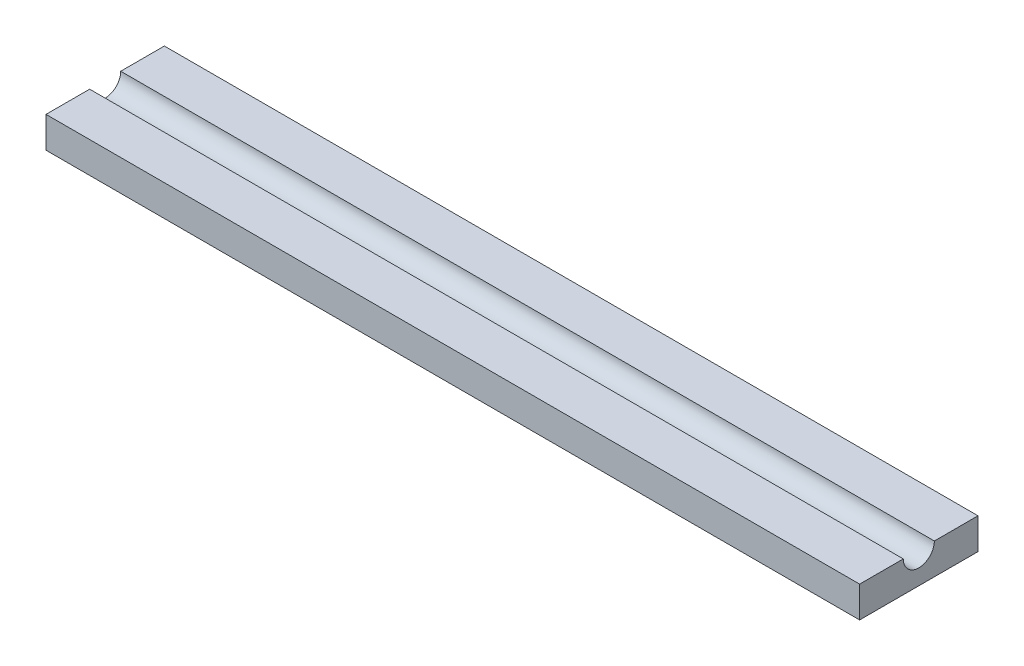
ISO-10303-21;
HEADER;
FILE_DESCRIPTION(('STEP AP214'),'2;1');
FILE_NAME('part.step','',(''),(''),'','','');
FILE_SCHEMA(('AUTOMOTIVE_DESIGN { 1 0 10303 214 1 1 1 1 }'));
ENDSEC;
DATA;
#1=APPLICATION_CONTEXT('core data for automotive mechanical design processes');
#2=APPLICATION_PROTOCOL_DEFINITION('international standard','automotive_design',2000,#1);
#3=PRODUCT_CONTEXT('',#1,'mechanical');
#4=PRODUCT('Part','Part','',(#3));
#5=PRODUCT_RELATED_PRODUCT_CATEGORY('part','',(#4));
#6=PRODUCT_DEFINITION_FORMATION('','',#4);
#7=PRODUCT_DEFINITION_CONTEXT('part definition',#1,'design');
#8=PRODUCT_DEFINITION('design','',#6,#7);
#9=PRODUCT_DEFINITION_SHAPE('','',#8);
#10=(LENGTH_UNIT() NAMED_UNIT(*) SI_UNIT(.MILLI.,.METRE.));
#11=(NAMED_UNIT(*) PLANE_ANGLE_UNIT() SI_UNIT($,.RADIAN.));
#12=(NAMED_UNIT(*) SI_UNIT($,.STERADIAN.) SOLID_ANGLE_UNIT());
#13=UNCERTAINTY_MEASURE_WITH_UNIT(LENGTH_MEASURE(1.E-05),#10,'distance_accuracy_value','');
#14=(GEOMETRIC_REPRESENTATION_CONTEXT(3) GLOBAL_UNCERTAINTY_ASSIGNED_CONTEXT((#13)) GLOBAL_UNIT_ASSIGNED_CONTEXT((#10,
#11,#12)) REPRESENTATION_CONTEXT('',''));
#15=CARTESIAN_POINT('',(0.,0.,0.));
#16=DIRECTION('',(0.,0.,1.));
#17=DIRECTION('',(1.,0.,0.));
#18=AXIS2_PLACEMENT_3D('',#15,#16,#17);
#19=CARTESIAN_POINT('',(0.,10.,0.));
#20=DIRECTION('',(0.,1.,0.));
#21=DIRECTION('',(0.,0.,1.));
#22=AXIS2_PLACEMENT_3D('',#19,#20,#21);
#23=PLANE('',#22);
#24=DIRECTION('',(1.,0.,0.));
#25=VECTOR('',#24,1.);
#26=CARTESIAN_POINT('',(-96.1195501536454,10.,4.43555555555555));
#27=LINE('',#26,#25);
#28=CARTESIAN_POINT('',(-81.9774145299145,10.,4.43555555555555));
#29=VERTEX_POINT('',#28);
#30=CARTESIAN_POINT('',(179.922585470086,10.,4.43555555555555));
#31=VERTEX_POINT('',#30);
#32=EDGE_CURVE('E11',#29,#31,#27,.T.);
#33=ORIENTED_EDGE('',*,*,#32,.F.);
#34=DIRECTION('',(0.,0.,1.));
#35=VECTOR('',#34,1.);
#36=CARTESIAN_POINT('',(-81.9774145299145,10.,-19.6144444444445));
#37=LINE('',#36,#35);
#38=CARTESIAN_POINT('',(-81.9774145299145,10.,18.4855555555555));
#39=VERTEX_POINT('',#38);
#40=EDGE_CURVE('E92',#29,#39,#37,.T.);
#41=ORIENTED_EDGE('',*,*,#40,.T.);
#42=DIRECTION('',(1.,0.,0.));
#43=VECTOR('',#42,1.);
#44=CARTESIAN_POINT('',(-81.9774145299145,10.,18.4855555555555));
#45=LINE('',#44,#43);
#46=CARTESIAN_POINT('',(179.922585470086,10.,18.4855555555555));
#47=VERTEX_POINT('',#46);
#48=EDGE_CURVE('E115',#39,#47,#45,.T.);
#49=ORIENTED_EDGE('',*,*,#48,.T.);
#50=DIRECTION('',(0.,0.,-1.));
#51=VECTOR('',#50,1.);
#52=CARTESIAN_POINT('',(179.922585470086,10.,-19.6144444444445));
#53=LINE('',#52,#51);
#54=EDGE_CURVE('E123',#47,#31,#53,.T.);
#55=ORIENTED_EDGE('',*,*,#54,.T.);
#56=EDGE_LOOP('',(#33,#41,#49,#55));
#57=FACE_BOUND('',#56,.T.);
#58=ADVANCED_FACE('F39',(#57),#23,.T.);
#59=CARTESIAN_POINT('',(-81.9774145299145,10.,-19.6144444444445));
#60=DIRECTION('',(1.,0.,0.));
#61=DIRECTION('',(0.,0.,-1.));
#62=AXIS2_PLACEMENT_3D('',#59,#60,#61);
#63=PLANE('',#62);
#64=ORIENTED_EDGE('',*,*,#40,.F.);
#65=CARTESIAN_POINT('',(-81.9774145299145,10.,-0.564444444444447));
#66=DIRECTION('',(1.,0.,0.));
#67=DIRECTION('',(0.,0.,-1.));
#68=AXIS2_PLACEMENT_3D('',#65,#66,#67);
#69=CIRCLE('',#68,5.);
#70=CARTESIAN_POINT('',(-81.9774145299145,10.,-5.56444444444445));
#71=VERTEX_POINT('',#70);
#72=EDGE_CURVE('E102',#71,#29,#69,.F.);
#73=ORIENTED_EDGE('',*,*,#72,.F.);
#74=CARTESIAN_POINT('',(-81.9774145299145,10.,-19.6144444444445));
#75=VERTEX_POINT('',#74);
#76=EDGE_CURVE('E108',#75,#71,#37,.T.);
#77=ORIENTED_EDGE('',*,*,#76,.F.);
#78=DIRECTION('',(0.,-1.,0.));
#79=VECTOR('',#78,1.);
#80=CARTESIAN_POINT('',(-81.9774145299145,10.,-19.6144444444445));
#81=LINE('',#80,#79);
#82=CARTESIAN_POINT('',(-81.9774145299145,0.,-19.6144444444445));
#83=VERTEX_POINT('',#82);
#84=EDGE_CURVE('E129',#75,#83,#81,.T.);
#85=ORIENTED_EDGE('',*,*,#84,.T.);
#86=DIRECTION('',(0.,0.,1.));
#87=VECTOR('',#86,1.);
#88=CARTESIAN_POINT('',(-81.9774145299145,0.,-19.6144444444445));
#89=LINE('',#88,#87);
#90=CARTESIAN_POINT('',(-81.9774145299145,0.,18.4855555555555));
#91=VERTEX_POINT('',#90);
#92=EDGE_CURVE('E111',#83,#91,#89,.T.);
#93=ORIENTED_EDGE('',*,*,#92,.T.);
#94=DIRECTION('',(0.,-1.,0.));
#95=VECTOR('',#94,1.);
#96=CARTESIAN_POINT('',(-81.9774145299145,10.,18.4855555555555));
#97=LINE('',#96,#95);
#98=EDGE_CURVE('E105',#39,#91,#97,.T.);
#99=ORIENTED_EDGE('',*,*,#98,.F.);
#100=EDGE_LOOP('',(#64,#73,#77,#85,#93,#99));
#101=FACE_BOUND('',#100,.T.);
#102=ADVANCED_FACE('F41',(#101),#63,.F.);
#103=CARTESIAN_POINT('',(-81.9774145299145,10.,18.4855555555555));
#104=DIRECTION('',(0.,0.,-1.));
#105=DIRECTION('',(-1.,0.,0.));
#106=AXIS2_PLACEMENT_3D('',#103,#104,#105);
#107=PLANE('',#106);
#108=DIRECTION('',(1.,0.,0.));
#109=VECTOR('',#108,1.);
#110=CARTESIAN_POINT('',(-81.9774145299145,0.,18.4855555555555));
#111=LINE('',#110,#109);
#112=CARTESIAN_POINT('',(179.922585470086,0.,18.4855555555555));
#113=VERTEX_POINT('',#112);
#114=EDGE_CURVE('E133',#91,#113,#111,.T.);
#115=ORIENTED_EDGE('',*,*,#114,.T.);
#116=DIRECTION('',(0.,-1.,0.));
#117=VECTOR('',#116,1.);
#118=CARTESIAN_POINT('',(179.922585470086,10.,18.4855555555555));
#119=LINE('',#118,#117);
#120=EDGE_CURVE('E146',#47,#113,#119,.T.);
#121=ORIENTED_EDGE('',*,*,#120,.F.);
#122=ORIENTED_EDGE('',*,*,#48,.F.);
#123=ORIENTED_EDGE('',*,*,#98,.T.);
#124=EDGE_LOOP('',(#115,#121,#122,#123));
#125=FACE_BOUND('',#124,.T.);
#126=ADVANCED_FACE('F153',(#125),#107,.F.);
#127=CARTESIAN_POINT('',(179.922585470086,10.,-19.6144444444445));
#128=DIRECTION('',(-1.,0.,0.));
#129=DIRECTION('',(0.,0.,1.));
#130=AXIS2_PLACEMENT_3D('',#127,#128,#129);
#131=PLANE('',#130);
#132=CARTESIAN_POINT('',(179.922585470086,10.,-5.56444444444445));
#133=VERTEX_POINT('',#132);
#134=CARTESIAN_POINT('',(179.922585470086,10.,-19.6144444444445));
#135=VERTEX_POINT('',#134);
#136=EDGE_CURVE('E119',#133,#135,#53,.T.);
#137=ORIENTED_EDGE('',*,*,#136,.F.);
#138=CARTESIAN_POINT('',(179.922585470086,10.,-0.564444444444447));
#139=DIRECTION('',(1.,0.,0.));
#140=DIRECTION('',(0.,0.,-1.));
#141=AXIS2_PLACEMENT_3D('',#138,#139,#140);
#142=CIRCLE('',#141,5.);
#143=EDGE_CURVE('E54',#31,#133,#142,.T.);
#144=ORIENTED_EDGE('',*,*,#143,.F.);
#145=ORIENTED_EDGE('',*,*,#54,.F.);
#146=ORIENTED_EDGE('',*,*,#120,.T.);
#147=DIRECTION('',(0.,0.,-1.));
#148=VECTOR('',#147,1.);
#149=CARTESIAN_POINT('',(179.922585470086,0.,-19.6144444444445));
#150=LINE('',#149,#148);
#151=CARTESIAN_POINT('',(179.922585470086,0.,-19.6144444444445));
#152=VERTEX_POINT('',#151);
#153=EDGE_CURVE('E136',#113,#152,#150,.T.);
#154=ORIENTED_EDGE('',*,*,#153,.T.);
#155=DIRECTION('',(0.,-1.,0.));
#156=VECTOR('',#155,1.);
#157=CARTESIAN_POINT('',(179.922585470086,10.,-19.6144444444445));
#158=LINE('',#157,#156);
#159=EDGE_CURVE('E143',#135,#152,#158,.T.);
#160=ORIENTED_EDGE('',*,*,#159,.F.);
#161=EDGE_LOOP('',(#137,#144,#145,#146,#154,#160));
#162=FACE_BOUND('',#161,.T.);
#163=ADVANCED_FACE('F161',(#162),#131,.F.);
#164=CARTESIAN_POINT('',(-81.9774145299145,10.,-19.6144444444445));
#165=DIRECTION('',(0.,0.,1.));
#166=DIRECTION('',(1.,0.,0.));
#167=AXIS2_PLACEMENT_3D('',#164,#165,#166);
#168=PLANE('',#167);
#169=DIRECTION('',(-1.,0.,0.));
#170=VECTOR('',#169,1.);
#171=CARTESIAN_POINT('',(-81.9774145299145,0.,-19.6144444444445));
#172=LINE('',#171,#170);
#173=EDGE_CURVE('E84',#152,#83,#172,.T.);
#174=ORIENTED_EDGE('',*,*,#173,.T.);
#175=ORIENTED_EDGE('',*,*,#84,.F.);
#176=DIRECTION('',(-1.,0.,0.));
#177=VECTOR('',#176,1.);
#178=CARTESIAN_POINT('',(-81.9774145299145,10.,-19.6144444444445));
#179=LINE('',#178,#177);
#180=EDGE_CURVE('E63',#135,#75,#179,.T.);
#181=ORIENTED_EDGE('',*,*,#180,.F.);
#182=ORIENTED_EDGE('',*,*,#159,.T.);
#183=EDGE_LOOP('',(#174,#175,#181,#182));
#184=FACE_BOUND('',#183,.T.);
#185=ADVANCED_FACE('F163',(#184),#168,.F.);
#186=DIRECTION('',(1.,0.,0.));
#187=VECTOR('',#186,1.);
#188=CARTESIAN_POINT('',(-96.1195501536454,10.,-5.56444444444445));
#189=LINE('',#188,#187);
#190=EDGE_CURVE('E48',#133,#71,#189,.F.);
#191=ORIENTED_EDGE('',*,*,#190,.F.);
#192=ORIENTED_EDGE('',*,*,#136,.T.);
#193=ORIENTED_EDGE('',*,*,#180,.T.);
#194=ORIENTED_EDGE('',*,*,#76,.T.);
#195=EDGE_LOOP('',(#191,#192,#193,#194));
#196=FACE_BOUND('',#195,.T.);
#197=ADVANCED_FACE('F113',(#196),#23,.T.);
#198=CARTESIAN_POINT('',(0.,0.,0.));
#199=DIRECTION('',(0.,1.,0.));
#200=DIRECTION('',(0.,0.,1.));
#201=AXIS2_PLACEMENT_3D('',#198,#199,#200);
#202=PLANE('',#201);
#203=ORIENTED_EDGE('',*,*,#92,.F.);
#204=ORIENTED_EDGE('',*,*,#173,.F.);
#205=ORIENTED_EDGE('',*,*,#153,.F.);
#206=ORIENTED_EDGE('',*,*,#114,.F.);
#207=EDGE_LOOP('',(#203,#204,#205,#206));
#208=FACE_BOUND('',#207,.T.);
#209=ADVANCED_FACE('F157',(#208),#202,.F.);
#210=CARTESIAN_POINT('',(-96.1195501536454,10.,-0.564444444444447));
#211=DIRECTION('',(1.,0.,0.));
#212=DIRECTION('',(0.,0.,-1.));
#213=AXIS2_PLACEMENT_3D('',#210,#211,#212);
#214=CYLINDRICAL_SURFACE('',#213,5.);
#215=ORIENTED_EDGE('',*,*,#32,.T.);
#216=ORIENTED_EDGE('',*,*,#143,.T.);
#217=ORIENTED_EDGE('',*,*,#190,.T.);
#218=ORIENTED_EDGE('',*,*,#72,.T.);
#219=EDGE_LOOP('',(#215,#216,#217,#218));
#220=FACE_BOUND('',#219,.T.);
#221=ADVANCED_FACE('F101',(#220),#214,.F.);
#222=CLOSED_SHELL('',(#58,#102,#126,#163,#185,#197,#209,#221));
#223=MANIFOLD_SOLID_BREP('B2',#222);
#224=ADVANCED_BREP_SHAPE_REPRESENTATION('',(#18,#223),#14);
#225=SHAPE_DEFINITION_REPRESENTATION(#9,#224);
ENDSEC;
END-ISO-10303-21;
